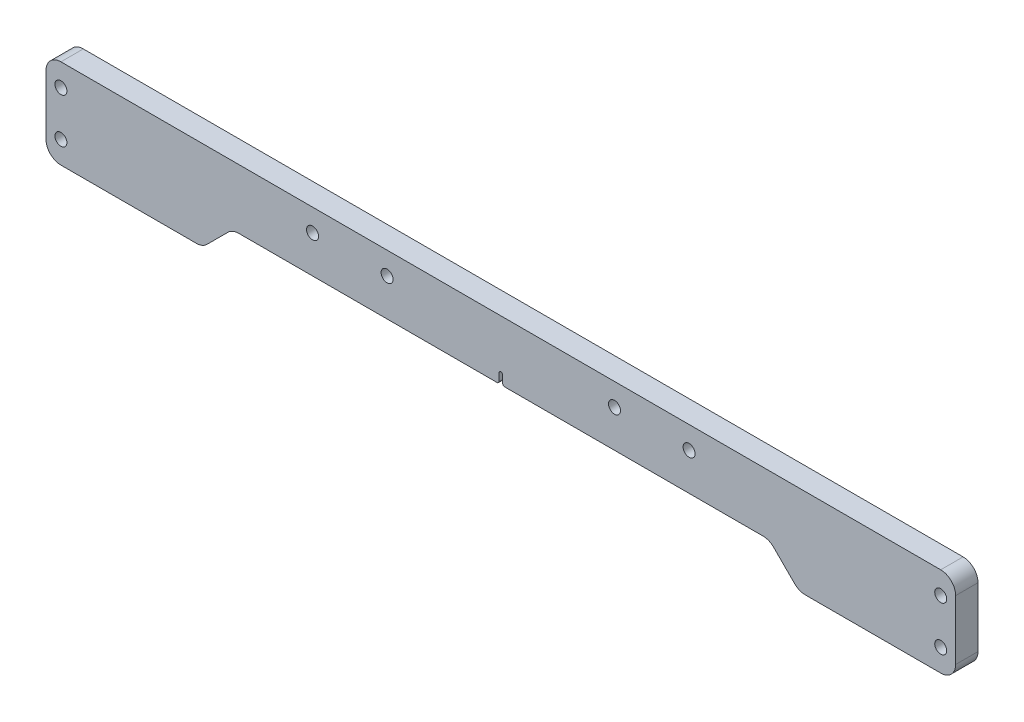
ISO-10303-21;
HEADER;
FILE_DESCRIPTION(('STEP AP214'),'2;1');
FILE_NAME('part.step','',(''),(''),'','','');
FILE_SCHEMA(('AUTOMOTIVE_DESIGN { 1 0 10303 214 1 1 1 1 }'));
ENDSEC;
DATA;
#1=APPLICATION_CONTEXT('core data for automotive mechanical design processes');
#2=APPLICATION_PROTOCOL_DEFINITION('international standard','automotive_design',2000,#1);
#3=PRODUCT_CONTEXT('',#1,'mechanical');
#4=PRODUCT('Part','Part','',(#3));
#5=PRODUCT_RELATED_PRODUCT_CATEGORY('part','',(#4));
#6=PRODUCT_DEFINITION_FORMATION('','',#4);
#7=PRODUCT_DEFINITION_CONTEXT('part definition',#1,'design');
#8=PRODUCT_DEFINITION('design','',#6,#7);
#9=PRODUCT_DEFINITION_SHAPE('','',#8);
#10=(LENGTH_UNIT() NAMED_UNIT(*) SI_UNIT(.MILLI.,.METRE.));
#11=(NAMED_UNIT(*) PLANE_ANGLE_UNIT() SI_UNIT($,.RADIAN.));
#12=(NAMED_UNIT(*) SI_UNIT($,.STERADIAN.) SOLID_ANGLE_UNIT());
#13=UNCERTAINTY_MEASURE_WITH_UNIT(LENGTH_MEASURE(1.E-05),#10,'distance_accuracy_value','');
#14=(GEOMETRIC_REPRESENTATION_CONTEXT(3) GLOBAL_UNCERTAINTY_ASSIGNED_CONTEXT((#13)) GLOBAL_UNIT_ASSIGNED_CONTEXT((#10,
#11,#12)) REPRESENTATION_CONTEXT('',''));
#15=CARTESIAN_POINT('',(0.,0.,0.));
#16=DIRECTION('',(0.,0.,1.));
#17=DIRECTION('',(1.,0.,0.));
#18=AXIS2_PLACEMENT_3D('',#15,#16,#17);
#19=CARTESIAN_POINT('',(-193.675,-19.05,9.525));
#20=DIRECTION('',(0.,0.,-1.));
#21=DIRECTION('',(-1.,0.,0.));
#22=AXIS2_PLACEMENT_3D('',#19,#20,#21);
#23=PLANE('',#22);
#24=CARTESIAN_POINT('',(-187.325,9.52500000000002,9.525));
#25=DIRECTION('',(0.,0.,1.));
#26=DIRECTION('',(1.,0.,0.));
#27=AXIS2_PLACEMENT_3D('',#24,#25,#26);
#28=CIRCLE('',#27,2.55269999999999);
#29=CARTESIAN_POINT('',(-184.7723,9.52500000000002,9.525));
#30=VERTEX_POINT('',#29);
#31=EDGE_CURVE('E247',#30,#30,#28,.T.);
#32=ORIENTED_EDGE('',*,*,#31,.F.);
#33=EDGE_LOOP('',(#32));
#34=FACE_BOUND('',#33,.T.);
#35=CARTESIAN_POINT('',(187.325,9.52500000000002,9.525));
#36=DIRECTION('',(0.,0.,1.));
#37=DIRECTION('',(1.,0.,0.));
#38=AXIS2_PLACEMENT_3D('',#35,#36,#37);
#39=CIRCLE('',#38,2.55269999999999);
#40=CARTESIAN_POINT('',(189.8777,9.52500000000002,9.525));
#41=VERTEX_POINT('',#40);
#42=EDGE_CURVE('E253',#41,#41,#39,.T.);
#43=ORIENTED_EDGE('',*,*,#42,.F.);
#44=EDGE_LOOP('',(#43));
#45=FACE_BOUND('',#44,.T.);
#46=CARTESIAN_POINT('',(-187.325,-9.525,9.525));
#47=DIRECTION('',(0.,0.,1.));
#48=DIRECTION('',(1.,0.,0.));
#49=AXIS2_PLACEMENT_3D('',#46,#47,#48);
#50=CIRCLE('',#49,2.55269999999999);
#51=CARTESIAN_POINT('',(-184.7723,-9.525,9.525));
#52=VERTEX_POINT('',#51);
#53=EDGE_CURVE('E259',#52,#52,#50,.T.);
#54=ORIENTED_EDGE('',*,*,#53,.F.);
#55=EDGE_LOOP('',(#54));
#56=FACE_BOUND('',#55,.T.);
#57=CARTESIAN_POINT('',(-48.4187500000001,9.52500000000017,9.525));
#58=DIRECTION('',(0.,0.,1.));
#59=DIRECTION('',(1.,0.,0.));
#60=AXIS2_PLACEMENT_3D('',#57,#58,#59);
#61=CIRCLE('',#60,2.5527);
#62=CARTESIAN_POINT('',(-45.8660500000001,9.52500000000017,9.525));
#63=VERTEX_POINT('',#62);
#64=EDGE_CURVE('E277',#63,#63,#61,.T.);
#65=ORIENTED_EDGE('',*,*,#64,.F.);
#66=EDGE_LOOP('',(#65));
#67=FACE_BOUND('',#66,.T.);
#68=CARTESIAN_POINT('',(80.1687499999999,9.52500000000017,9.525));
#69=DIRECTION('',(0.,0.,1.));
#70=DIRECTION('',(1.,0.,0.));
#71=AXIS2_PLACEMENT_3D('',#68,#69,#70);
#72=CIRCLE('',#71,2.55270000000001);
#73=CARTESIAN_POINT('',(82.7214499999999,9.52500000000017,9.525));
#74=VERTEX_POINT('',#73);
#75=EDGE_CURVE('E289',#74,#74,#72,.T.);
#76=ORIENTED_EDGE('',*,*,#75,.F.);
#77=EDGE_LOOP('',(#76));
#78=FACE_BOUND('',#77,.T.);
#79=CARTESIAN_POINT('',(48.4187499999999,9.52500000000017,9.525));
#80=DIRECTION('',(0.,0.,1.));
#81=DIRECTION('',(1.,0.,0.));
#82=AXIS2_PLACEMENT_3D('',#79,#80,#81);
#83=CIRCLE('',#82,2.5527);
#84=CARTESIAN_POINT('',(50.9714499999999,9.52500000000017,9.525));
#85=VERTEX_POINT('',#84);
#86=EDGE_CURVE('E283',#85,#85,#83,.T.);
#87=ORIENTED_EDGE('',*,*,#86,.F.);
#88=EDGE_LOOP('',(#87));
#89=FACE_BOUND('',#88,.T.);
#90=CARTESIAN_POINT('',(-80.1687500000001,9.52500000000017,9.525));
#91=DIRECTION('',(0.,0.,1.));
#92=DIRECTION('',(1.,0.,0.));
#93=AXIS2_PLACEMENT_3D('',#90,#91,#92);
#94=CIRCLE('',#93,2.55270000000001);
#95=CARTESIAN_POINT('',(-77.6160500000001,9.52500000000017,9.525));
#96=VERTEX_POINT('',#95);
#97=EDGE_CURVE('E271',#96,#96,#94,.T.);
#98=ORIENTED_EDGE('',*,*,#97,.F.);
#99=EDGE_LOOP('',(#98));
#100=FACE_BOUND('',#99,.T.);
#101=CARTESIAN_POINT('',(187.325,-9.525,9.525));
#102=DIRECTION('',(0.,0.,1.));
#103=DIRECTION('',(1.,0.,0.));
#104=AXIS2_PLACEMENT_3D('',#101,#102,#103);
#105=CIRCLE('',#104,2.55269999999999);
#106=CARTESIAN_POINT('',(189.8777,-9.525,9.525));
#107=VERTEX_POINT('',#106);
#108=EDGE_CURVE('E265',#107,#107,#105,.T.);
#109=ORIENTED_EDGE('',*,*,#108,.F.);
#110=EDGE_LOOP('',(#109));
#111=FACE_BOUND('',#110,.T.);
#112=DIRECTION('',(0.,1.,0.));
#113=VECTOR('',#112,1.);
#114=CARTESIAN_POINT('',(0.79375000000001,-19.05,9.525));
#115=LINE('',#114,#113);
#116=CARTESIAN_POINT('',(0.79375000000001,-5.55625000000003,9.525));
#117=VERTEX_POINT('',#116);
#118=CARTESIAN_POINT('',(0.79375000000001,-2.37490000000002,9.525));
#119=VERTEX_POINT('',#118);
#120=EDGE_CURVE('E199',#117,#119,#115,.T.);
#121=ORIENTED_EDGE('',*,*,#120,.F.);
#122=CARTESIAN_POINT('',(1.5875,-5.55625000000003,9.525));
#123=DIRECTION('',(0.,0.,-1.));
#124=DIRECTION('',(-1.,0.,0.));
#125=AXIS2_PLACEMENT_3D('',#122,#123,#124);
#126=CIRCLE('',#125,0.79375);
#127=CARTESIAN_POINT('',(1.58750000000003,-6.35000000000003,9.525));
#128=VERTEX_POINT('',#127);
#129=EDGE_CURVE('E418',#117,#128,#126,.F.);
#130=ORIENTED_EDGE('',*,*,#129,.T.);
#131=DIRECTION('',(-1.,0.,0.));
#132=VECTOR('',#131,1.);
#133=CARTESIAN_POINT('',(114.3,-6.35000000000002,9.525));
#134=LINE('',#133,#132);
#135=CARTESIAN_POINT('',(111.669743878931,-6.35000000000002,9.525));
#136=VERTEX_POINT('',#135);
#137=EDGE_CURVE('E296',#136,#128,#134,.T.);
#138=ORIENTED_EDGE('',*,*,#137,.F.);
#139=CARTESIAN_POINT('',(111.669743878931,-12.7,9.525));
#140=DIRECTION('',(0.,0.,-1.));
#141=DIRECTION('',(-1.,0.,0.));
#142=AXIS2_PLACEMENT_3D('',#139,#140,#141);
#143=CIRCLE('',#142,6.35);
#144=CARTESIAN_POINT('',(116.159871939465,-8.20987193946544,9.525));
#145=VERTEX_POINT('',#144);
#146=EDGE_CURVE('E411',#136,#145,#143,.T.);
#147=ORIENTED_EDGE('',*,*,#146,.T.);
#148=DIRECTION('',(-0.707106781186548,0.707106781186547,0.));
#149=VECTOR('',#148,1.);
#150=CARTESIAN_POINT('',(114.3,-6.35,9.525));
#151=LINE('',#150,#149);
#152=CARTESIAN_POINT('',(125.140128060535,-17.1901280605346,9.525));
#153=VERTEX_POINT('',#152);
#154=EDGE_CURVE('E332',#145,#153,#151,.F.);
#155=ORIENTED_EDGE('',*,*,#154,.T.);
#156=CARTESIAN_POINT('',(129.630256121069,-12.7,9.525));
#157=DIRECTION('',(0.,0.,-1.));
#158=DIRECTION('',(-1.,0.,0.));
#159=AXIS2_PLACEMENT_3D('',#156,#157,#158);
#160=CIRCLE('',#159,6.35);
#161=CARTESIAN_POINT('',(129.630256121069,-19.05,9.525));
#162=VERTEX_POINT('',#161);
#163=EDGE_CURVE('E355',#153,#162,#160,.F.);
#164=ORIENTED_EDGE('',*,*,#163,.T.);
#165=DIRECTION('',(1.,0.,0.));
#166=VECTOR('',#165,1.);
#167=CARTESIAN_POINT('',(193.675,-19.05,9.525));
#168=LINE('',#167,#166);
#169=CARTESIAN_POINT('',(187.325,-19.05,9.525));
#170=VERTEX_POINT('',#169);
#171=EDGE_CURVE('E307',#162,#170,#168,.T.);
#172=ORIENTED_EDGE('',*,*,#171,.T.);
#173=CARTESIAN_POINT('',(187.325,-12.7,9.525));
#174=DIRECTION('',(0.,0.,-1.));
#175=DIRECTION('',(-1.,0.,0.));
#176=AXIS2_PLACEMENT_3D('',#173,#174,#175);
#177=CIRCLE('',#176,6.35);
#178=CARTESIAN_POINT('',(193.675,-12.7,9.525));
#179=VERTEX_POINT('',#178);
#180=EDGE_CURVE('E351',#170,#179,#177,.F.);
#181=ORIENTED_EDGE('',*,*,#180,.T.);
#182=DIRECTION('',(0.,1.,0.));
#183=VECTOR('',#182,1.);
#184=CARTESIAN_POINT('',(193.675,19.05,9.525));
#185=LINE('',#184,#183);
#186=CARTESIAN_POINT('',(193.675,12.7,9.525));
#187=VERTEX_POINT('',#186);
#188=EDGE_CURVE('E312',#179,#187,#185,.T.);
#189=ORIENTED_EDGE('',*,*,#188,.T.);
#190=CARTESIAN_POINT('',(187.325,12.7,9.525));
#191=DIRECTION('',(0.,0.,-1.));
#192=DIRECTION('',(-1.,0.,0.));
#193=AXIS2_PLACEMENT_3D('',#190,#191,#192);
#194=CIRCLE('',#193,6.35);
#195=CARTESIAN_POINT('',(187.325,19.05,9.525));
#196=VERTEX_POINT('',#195);
#197=EDGE_CURVE('E349',#187,#196,#194,.F.);
#198=ORIENTED_EDGE('',*,*,#197,.T.);
#199=DIRECTION('',(-1.,0.,0.));
#200=VECTOR('',#199,1.);
#201=CARTESIAN_POINT('',(193.675,19.05,9.525));
#202=LINE('',#201,#200);
#203=CARTESIAN_POINT('',(-187.325,19.05,9.525));
#204=VERTEX_POINT('',#203);
#205=EDGE_CURVE('E315',#196,#204,#202,.T.);
#206=ORIENTED_EDGE('',*,*,#205,.T.);
#207=CARTESIAN_POINT('',(-187.325,12.7,9.525));
#208=DIRECTION('',(0.,0.,-1.));
#209=DIRECTION('',(-1.,0.,0.));
#210=AXIS2_PLACEMENT_3D('',#207,#208,#209);
#211=CIRCLE('',#210,6.35);
#212=CARTESIAN_POINT('',(-193.675,12.7,9.525));
#213=VERTEX_POINT('',#212);
#214=EDGE_CURVE('E347',#204,#213,#211,.F.);
#215=ORIENTED_EDGE('',*,*,#214,.T.);
#216=DIRECTION('',(0.,-1.,0.));
#217=VECTOR('',#216,1.);
#218=CARTESIAN_POINT('',(-193.675,19.05,9.525));
#219=LINE('',#218,#217);
#220=CARTESIAN_POINT('',(-193.675,-12.7,9.525));
#221=VERTEX_POINT('',#220);
#222=EDGE_CURVE('E304',#213,#221,#219,.T.);
#223=ORIENTED_EDGE('',*,*,#222,.T.);
#224=CARTESIAN_POINT('',(-187.325,-12.7,9.525));
#225=DIRECTION('',(0.,0.,-1.));
#226=DIRECTION('',(-1.,0.,0.));
#227=AXIS2_PLACEMENT_3D('',#224,#225,#226);
#228=CIRCLE('',#227,6.35);
#229=CARTESIAN_POINT('',(-187.325,-19.05,9.525));
#230=VERTEX_POINT('',#229);
#231=EDGE_CURVE('E353',#221,#230,#228,.F.);
#232=ORIENTED_EDGE('',*,*,#231,.T.);
#233=CARTESIAN_POINT('',(-129.630256121069,-19.05,9.525));
#234=VERTEX_POINT('',#233);
#235=EDGE_CURVE('E311',#230,#234,#168,.T.);
#236=ORIENTED_EDGE('',*,*,#235,.T.);
#237=CARTESIAN_POINT('',(-129.630256121069,-12.7,9.525));
#238=DIRECTION('',(0.,0.,-1.));
#239=DIRECTION('',(-1.,0.,0.));
#240=AXIS2_PLACEMENT_3D('',#237,#238,#239);
#241=CIRCLE('',#240,6.35);
#242=CARTESIAN_POINT('',(-125.140128060535,-17.1901280605346,9.525));
#243=VERTEX_POINT('',#242);
#244=EDGE_CURVE('E357',#234,#243,#241,.F.);
#245=ORIENTED_EDGE('',*,*,#244,.T.);
#246=DIRECTION('',(-0.707106781186547,-0.707106781186548,0.));
#247=VECTOR('',#246,1.);
#248=CARTESIAN_POINT('',(-127.,-19.05,9.525));
#249=LINE('',#248,#247);
#250=CARTESIAN_POINT('',(-116.159871939466,-8.20987193946548,9.525));
#251=VERTEX_POINT('',#250);
#252=EDGE_CURVE('E318',#243,#251,#249,.F.);
#253=ORIENTED_EDGE('',*,*,#252,.T.);
#254=CARTESIAN_POINT('',(-111.669743878931,-12.7,9.525));
#255=DIRECTION('',(0.,0.,-1.));
#256=DIRECTION('',(-1.,0.,0.));
#257=AXIS2_PLACEMENT_3D('',#254,#255,#256);
#258=CIRCLE('',#257,6.35);
#259=CARTESIAN_POINT('',(-111.669743878931,-6.35000000000005,9.525));
#260=VERTEX_POINT('',#259);
#261=EDGE_CURVE('E406',#251,#260,#258,.T.);
#262=ORIENTED_EDGE('',*,*,#261,.T.);
#263=CARTESIAN_POINT('',(-1.58749999999998,-6.35000000000003,9.525));
#264=VERTEX_POINT('',#263);
#265=EDGE_CURVE('E295',#264,#260,#134,.T.);
#266=ORIENTED_EDGE('',*,*,#265,.F.);
#267=CARTESIAN_POINT('',(-1.58750000000001,-5.55625000000003,9.525));
#268=DIRECTION('',(0.,0.,-1.));
#269=DIRECTION('',(-1.,0.,0.));
#270=AXIS2_PLACEMENT_3D('',#267,#268,#269);
#271=CIRCLE('',#270,0.79375);
#272=CARTESIAN_POINT('',(-0.79375000000001,-5.55625000000003,9.525));
#273=VERTEX_POINT('',#272);
#274=EDGE_CURVE('E416',#264,#273,#271,.F.);
#275=ORIENTED_EDGE('',*,*,#274,.T.);
#276=DIRECTION('',(0.,1.,0.));
#277=VECTOR('',#276,1.);
#278=CARTESIAN_POINT('',(-0.79375000000001,-19.05,9.525));
#279=LINE('',#278,#277);
#280=CARTESIAN_POINT('',(-0.79375000000001,-2.37490000000002,9.525));
#281=VERTEX_POINT('',#280);
#282=EDGE_CURVE('E227',#281,#273,#279,.F.);
#283=ORIENTED_EDGE('',*,*,#282,.F.);
#284=CARTESIAN_POINT('',(-0.00635000000000002,-2.37490000000002,9.525));
#285=DIRECTION('',(0.,0.,-1.));
#286=DIRECTION('',(-1.,0.,0.));
#287=AXIS2_PLACEMENT_3D('',#284,#285,#286);
#288=CIRCLE('',#287,0.7874);
#289=CARTESIAN_POINT('',(-0.00634999999998831,-1.58750000000002,9.525));
#290=VERTEX_POINT('',#289);
#291=EDGE_CURVE('E223',#290,#281,#288,.F.);
#292=ORIENTED_EDGE('',*,*,#291,.F.);
#293=DIRECTION('',(-1.,0.,0.));
#294=VECTOR('',#293,1.);
#295=CARTESIAN_POINT('',(-193.675,-1.58750000000002,9.525));
#296=LINE('',#295,#294);
#297=CARTESIAN_POINT('',(0.00634999999998831,-1.58750000000002,9.525));
#298=VERTEX_POINT('',#297);
#299=EDGE_CURVE('E221',#298,#290,#296,.T.);
#300=ORIENTED_EDGE('',*,*,#299,.F.);
#301=CARTESIAN_POINT('',(0.00635000000000002,-2.37490000000002,9.525));
#302=DIRECTION('',(0.,0.,-1.));
#303=DIRECTION('',(-1.,0.,0.));
#304=AXIS2_PLACEMENT_3D('',#301,#302,#303);
#305=CIRCLE('',#304,0.7874);
#306=EDGE_CURVE('E208',#119,#298,#305,.F.);
#307=ORIENTED_EDGE('',*,*,#306,.F.);
#308=EDGE_LOOP('',(#121,#130,#138,#147,#155,#164,#172,#181,#189,#198,#206,#215,#223,#232,#236,
#245,#253,#262,#266,#275,#283,#292,#300,#307));
#309=FACE_BOUND('',#308,.T.);
#310=ADVANCED_FACE('F38',(#34,#45,#56,#67,#78,#89,#100,#111,#309),#23,.F.);
#311=CARTESIAN_POINT('',(-193.675,-19.05,0.));
#312=DIRECTION('',(0.,0.,-1.));
#313=DIRECTION('',(-1.,0.,0.));
#314=AXIS2_PLACEMENT_3D('',#311,#312,#313);
#315=PLANE('',#314);
#316=CARTESIAN_POINT('',(-187.325,9.52500000000002,0.));
#317=DIRECTION('',(0.,0.,-1.));
#318=DIRECTION('',(-1.,0.,0.));
#319=AXIS2_PLACEMENT_3D('',#316,#317,#318);
#320=CIRCLE('',#319,2.55269999999999);
#321=CARTESIAN_POINT('',(-189.8777,9.52500000000002,0.));
#322=VERTEX_POINT('',#321);
#323=EDGE_CURVE('E250',#322,#322,#320,.T.);
#324=ORIENTED_EDGE('',*,*,#323,.F.);
#325=EDGE_LOOP('',(#324));
#326=FACE_BOUND('',#325,.T.);
#327=CARTESIAN_POINT('',(187.325,9.52500000000002,0.));
#328=DIRECTION('',(0.,0.,-1.));
#329=DIRECTION('',(-1.,0.,0.));
#330=AXIS2_PLACEMENT_3D('',#327,#328,#329);
#331=CIRCLE('',#330,2.55269999999999);
#332=CARTESIAN_POINT('',(184.7723,9.52500000000002,0.));
#333=VERTEX_POINT('',#332);
#334=EDGE_CURVE('E256',#333,#333,#331,.T.);
#335=ORIENTED_EDGE('',*,*,#334,.F.);
#336=EDGE_LOOP('',(#335));
#337=FACE_BOUND('',#336,.T.);
#338=CARTESIAN_POINT('',(-187.325,-9.525,0.));
#339=DIRECTION('',(0.,0.,-1.));
#340=DIRECTION('',(-1.,0.,0.));
#341=AXIS2_PLACEMENT_3D('',#338,#339,#340);
#342=CIRCLE('',#341,2.55269999999999);
#343=CARTESIAN_POINT('',(-189.8777,-9.525,0.));
#344=VERTEX_POINT('',#343);
#345=EDGE_CURVE('E262',#344,#344,#342,.T.);
#346=ORIENTED_EDGE('',*,*,#345,.F.);
#347=EDGE_LOOP('',(#346));
#348=FACE_BOUND('',#347,.T.);
#349=CARTESIAN_POINT('',(187.325,-9.525,0.));
#350=DIRECTION('',(0.,0.,-1.));
#351=DIRECTION('',(-1.,0.,0.));
#352=AXIS2_PLACEMENT_3D('',#349,#350,#351);
#353=CIRCLE('',#352,2.55269999999999);
#354=CARTESIAN_POINT('',(184.7723,-9.525,0.));
#355=VERTEX_POINT('',#354);
#356=EDGE_CURVE('E268',#355,#355,#353,.T.);
#357=ORIENTED_EDGE('',*,*,#356,.F.);
#358=EDGE_LOOP('',(#357));
#359=FACE_BOUND('',#358,.T.);
#360=CARTESIAN_POINT('',(-80.1687500000001,9.52500000000017,0.));
#361=DIRECTION('',(0.,0.,-1.));
#362=DIRECTION('',(-1.,0.,0.));
#363=AXIS2_PLACEMENT_3D('',#360,#361,#362);
#364=CIRCLE('',#363,2.5527);
#365=CARTESIAN_POINT('',(-82.7214500000001,9.52500000000017,0.));
#366=VERTEX_POINT('',#365);
#367=EDGE_CURVE('E274',#366,#366,#364,.T.);
#368=ORIENTED_EDGE('',*,*,#367,.F.);
#369=EDGE_LOOP('',(#368));
#370=FACE_BOUND('',#369,.T.);
#371=CARTESIAN_POINT('',(-48.4187500000001,9.52500000000017,0.));
#372=DIRECTION('',(0.,0.,-1.));
#373=DIRECTION('',(-1.,0.,0.));
#374=AXIS2_PLACEMENT_3D('',#371,#372,#373);
#375=CIRCLE('',#374,2.5527);
#376=CARTESIAN_POINT('',(-50.9714500000001,9.52500000000017,0.));
#377=VERTEX_POINT('',#376);
#378=EDGE_CURVE('E280',#377,#377,#375,.T.);
#379=ORIENTED_EDGE('',*,*,#378,.F.);
#380=EDGE_LOOP('',(#379));
#381=FACE_BOUND('',#380,.T.);
#382=CARTESIAN_POINT('',(48.4187499999999,9.52500000000017,0.));
#383=DIRECTION('',(0.,0.,-1.));
#384=DIRECTION('',(-1.,0.,0.));
#385=AXIS2_PLACEMENT_3D('',#382,#383,#384);
#386=CIRCLE('',#385,2.5527);
#387=CARTESIAN_POINT('',(45.8660499999999,9.52500000000017,0.));
#388=VERTEX_POINT('',#387);
#389=EDGE_CURVE('E286',#388,#388,#386,.T.);
#390=ORIENTED_EDGE('',*,*,#389,.F.);
#391=EDGE_LOOP('',(#390));
#392=FACE_BOUND('',#391,.T.);
#393=CARTESIAN_POINT('',(80.1687499999999,9.52500000000017,0.));
#394=DIRECTION('',(0.,0.,-1.));
#395=DIRECTION('',(-1.,0.,0.));
#396=AXIS2_PLACEMENT_3D('',#393,#394,#395);
#397=CIRCLE('',#396,2.5527);
#398=CARTESIAN_POINT('',(77.6160499999999,9.52500000000017,0.));
#399=VERTEX_POINT('',#398);
#400=EDGE_CURVE('E292',#399,#399,#397,.T.);
#401=ORIENTED_EDGE('',*,*,#400,.F.);
#402=EDGE_LOOP('',(#401));
#403=FACE_BOUND('',#402,.T.);
#404=DIRECTION('',(-1.,0.,0.));
#405=VECTOR('',#404,1.);
#406=CARTESIAN_POINT('',(114.3,-6.35000000000002,0.));
#407=LINE('',#406,#405);
#408=CARTESIAN_POINT('',(111.669743878931,-6.35000000000002,0.));
#409=VERTEX_POINT('',#408);
#410=CARTESIAN_POINT('',(1.58750000000001,-6.35000000000003,0.));
#411=VERTEX_POINT('',#410);
#412=EDGE_CURVE('E300',#409,#411,#407,.T.);
#413=ORIENTED_EDGE('',*,*,#412,.T.);
#414=CARTESIAN_POINT('',(1.5875,-5.55625000000003,0.));
#415=DIRECTION('',(0.,0.,-1.));
#416=DIRECTION('',(-1.,0.,0.));
#417=AXIS2_PLACEMENT_3D('',#414,#415,#416);
#418=CIRCLE('',#417,0.79375);
#419=CARTESIAN_POINT('',(0.793750000000001,-5.55625000000003,0.));
#420=VERTEX_POINT('',#419);
#421=EDGE_CURVE('E423',#411,#420,#418,.T.);
#422=ORIENTED_EDGE('',*,*,#421,.T.);
#423=DIRECTION('',(0.,1.,0.));
#424=VECTOR('',#423,1.);
#425=CARTESIAN_POINT('',(0.793750000000001,-6.35000000000002,0.));
#426=LINE('',#425,#424);
#427=CARTESIAN_POINT('',(0.79375,-2.37490000000002,0.));
#428=VERTEX_POINT('',#427);
#429=EDGE_CURVE('E229',#420,#428,#426,.T.);
#430=ORIENTED_EDGE('',*,*,#429,.T.);
#431=CARTESIAN_POINT('',(0.00635000000000002,-2.37490000000002,0.));
#432=DIRECTION('',(0.,0.,-1.));
#433=DIRECTION('',(-1.,0.,0.));
#434=AXIS2_PLACEMENT_3D('',#431,#432,#433);
#435=CIRCLE('',#434,0.7874);
#436=CARTESIAN_POINT('',(0.00635000000000007,-1.58750000000002,0.));
#437=VERTEX_POINT('',#436);
#438=EDGE_CURVE('E216',#428,#437,#435,.F.);
#439=ORIENTED_EDGE('',*,*,#438,.T.);
#440=DIRECTION('',(-1.,0.,0.));
#441=VECTOR('',#440,1.);
#442=CARTESIAN_POINT('',(-0.00635000000000002,-1.58750000000002,0.));
#443=LINE('',#442,#441);
#444=CARTESIAN_POINT('',(-0.00635000000000002,-1.58750000000002,0.));
#445=VERTEX_POINT('',#444);
#446=EDGE_CURVE('E235',#437,#445,#443,.T.);
#447=ORIENTED_EDGE('',*,*,#446,.T.);
#448=CARTESIAN_POINT('',(-0.00635000000000002,-2.37490000000002,0.));
#449=DIRECTION('',(0.,0.,-1.));
#450=DIRECTION('',(-1.,0.,0.));
#451=AXIS2_PLACEMENT_3D('',#448,#449,#450);
#452=CIRCLE('',#451,0.7874);
#453=CARTESIAN_POINT('',(-0.79375,-2.37490000000002,0.));
#454=VERTEX_POINT('',#453);
#455=EDGE_CURVE('E232',#445,#454,#452,.F.);
#456=ORIENTED_EDGE('',*,*,#455,.T.);
#457=DIRECTION('',(0.,-1.,0.));
#458=VECTOR('',#457,1.);
#459=CARTESIAN_POINT('',(-0.793749999999999,-6.35000000000002,0.));
#460=LINE('',#459,#458);
#461=CARTESIAN_POINT('',(-0.793749999999999,-5.55625000000003,0.));
#462=VERTEX_POINT('',#461);
#463=EDGE_CURVE('E230',#454,#462,#460,.T.);
#464=ORIENTED_EDGE('',*,*,#463,.T.);
#465=CARTESIAN_POINT('',(-1.58750000000001,-5.55625000000003,0.));
#466=DIRECTION('',(0.,0.,-1.));
#467=DIRECTION('',(-1.,0.,0.));
#468=AXIS2_PLACEMENT_3D('',#465,#466,#467);
#469=CIRCLE('',#468,0.79375);
#470=CARTESIAN_POINT('',(-1.58750000000001,-6.35000000000003,0.));
#471=VERTEX_POINT('',#470);
#472=EDGE_CURVE('E53',#462,#471,#469,.T.);
#473=ORIENTED_EDGE('',*,*,#472,.T.);
#474=CARTESIAN_POINT('',(-111.669743878931,-6.35000000000005,0.));
#475=VERTEX_POINT('',#474);
#476=EDGE_CURVE('E299',#471,#475,#407,.T.);
#477=ORIENTED_EDGE('',*,*,#476,.T.);
#478=CARTESIAN_POINT('',(-111.669743878931,-12.7,0.));
#479=DIRECTION('',(0.,0.,-1.));
#480=DIRECTION('',(-1.,0.,0.));
#481=AXIS2_PLACEMENT_3D('',#478,#479,#480);
#482=CIRCLE('',#481,6.35);
#483=CARTESIAN_POINT('',(-116.159871939466,-8.20987193946547,0.));
#484=VERTEX_POINT('',#483);
#485=EDGE_CURVE('E409',#475,#484,#482,.F.);
#486=ORIENTED_EDGE('',*,*,#485,.T.);
#487=DIRECTION('',(0.707106781186547,0.707106781186548,0.));
#488=VECTOR('',#487,1.);
#489=CARTESIAN_POINT('',(-160.3375,-52.3875,0.));
#490=LINE('',#489,#488);
#491=CARTESIAN_POINT('',(-125.140128060535,-17.1901280605346,0.));
#492=VERTEX_POINT('',#491);
#493=EDGE_CURVE('E335',#484,#492,#490,.F.);
#494=ORIENTED_EDGE('',*,*,#493,.T.);
#495=CARTESIAN_POINT('',(-129.630256121069,-12.7,0.));
#496=DIRECTION('',(0.,0.,-1.));
#497=DIRECTION('',(-1.,0.,0.));
#498=AXIS2_PLACEMENT_3D('',#495,#496,#497);
#499=CIRCLE('',#498,6.35);
#500=CARTESIAN_POINT('',(-129.630256121069,-19.05,0.));
#501=VERTEX_POINT('',#500);
#502=EDGE_CURVE('E374',#492,#501,#499,.T.);
#503=ORIENTED_EDGE('',*,*,#502,.T.);
#504=DIRECTION('',(1.,0.,0.));
#505=VECTOR('',#504,1.);
#506=CARTESIAN_POINT('',(193.675,-19.05,0.));
#507=LINE('',#506,#505);
#508=CARTESIAN_POINT('',(-187.325,-19.05,0.));
#509=VERTEX_POINT('',#508);
#510=EDGE_CURVE('E324',#509,#501,#507,.T.);
#511=ORIENTED_EDGE('',*,*,#510,.F.);
#512=CARTESIAN_POINT('',(-187.325,-12.7,0.));
#513=DIRECTION('',(0.,0.,-1.));
#514=DIRECTION('',(-1.,0.,0.));
#515=AXIS2_PLACEMENT_3D('',#512,#513,#514);
#516=CIRCLE('',#515,6.35);
#517=CARTESIAN_POINT('',(-193.675,-12.7,0.));
#518=VERTEX_POINT('',#517);
#519=EDGE_CURVE('E370',#509,#518,#516,.T.);
#520=ORIENTED_EDGE('',*,*,#519,.T.);
#521=DIRECTION('',(0.,-1.,0.));
#522=VECTOR('',#521,1.);
#523=CARTESIAN_POINT('',(-193.675,19.05,0.));
#524=LINE('',#523,#522);
#525=CARTESIAN_POINT('',(-193.675,12.7,0.));
#526=VERTEX_POINT('',#525);
#527=EDGE_CURVE('E303',#526,#518,#524,.T.);
#528=ORIENTED_EDGE('',*,*,#527,.F.);
#529=CARTESIAN_POINT('',(-187.325,12.7,0.));
#530=DIRECTION('',(0.,0.,-1.));
#531=DIRECTION('',(-1.,0.,0.));
#532=AXIS2_PLACEMENT_3D('',#529,#530,#531);
#533=CIRCLE('',#532,6.35);
#534=CARTESIAN_POINT('',(-187.325,19.05,0.));
#535=VERTEX_POINT('',#534);
#536=EDGE_CURVE('E364',#526,#535,#533,.T.);
#537=ORIENTED_EDGE('',*,*,#536,.T.);
#538=DIRECTION('',(-1.,0.,0.));
#539=VECTOR('',#538,1.);
#540=CARTESIAN_POINT('',(193.675,19.05,0.));
#541=LINE('',#540,#539);
#542=CARTESIAN_POINT('',(187.325,19.05,0.));
#543=VERTEX_POINT('',#542);
#544=EDGE_CURVE('E308',#543,#535,#541,.T.);
#545=ORIENTED_EDGE('',*,*,#544,.F.);
#546=CARTESIAN_POINT('',(187.325,12.7,0.));
#547=DIRECTION('',(0.,0.,-1.));
#548=DIRECTION('',(-1.,0.,0.));
#549=AXIS2_PLACEMENT_3D('',#546,#547,#548);
#550=CIRCLE('',#549,6.35);
#551=CARTESIAN_POINT('',(193.675,12.7,0.));
#552=VERTEX_POINT('',#551);
#553=EDGE_CURVE('E366',#543,#552,#550,.T.);
#554=ORIENTED_EDGE('',*,*,#553,.T.);
#555=DIRECTION('',(0.,1.,0.));
#556=VECTOR('',#555,1.);
#557=CARTESIAN_POINT('',(193.675,19.05,0.));
#558=LINE('',#557,#556);
#559=CARTESIAN_POINT('',(193.675,-12.7,0.));
#560=VERTEX_POINT('',#559);
#561=EDGE_CURVE('E325',#560,#552,#558,.T.);
#562=ORIENTED_EDGE('',*,*,#561,.F.);
#563=CARTESIAN_POINT('',(187.325,-12.7,0.));
#564=DIRECTION('',(0.,0.,-1.));
#565=DIRECTION('',(-1.,0.,0.));
#566=AXIS2_PLACEMENT_3D('',#563,#564,#565);
#567=CIRCLE('',#566,6.35);
#568=CARTESIAN_POINT('',(187.325,-19.05,0.));
#569=VERTEX_POINT('',#568);
#570=EDGE_CURVE('E368',#560,#569,#567,.T.);
#571=ORIENTED_EDGE('',*,*,#570,.T.);
#572=CARTESIAN_POINT('',(129.630256121069,-19.05,0.));
#573=VERTEX_POINT('',#572);
#574=EDGE_CURVE('E321',#573,#569,#507,.T.);
#575=ORIENTED_EDGE('',*,*,#574,.F.);
#576=CARTESIAN_POINT('',(129.630256121069,-12.7,0.));
#577=DIRECTION('',(0.,0.,-1.));
#578=DIRECTION('',(-1.,0.,0.));
#579=AXIS2_PLACEMENT_3D('',#576,#577,#578);
#580=CIRCLE('',#579,6.35);
#581=CARTESIAN_POINT('',(125.140128060535,-17.1901280605346,0.));
#582=VERTEX_POINT('',#581);
#583=EDGE_CURVE('E372',#573,#582,#580,.T.);
#584=ORIENTED_EDGE('',*,*,#583,.T.);
#585=DIRECTION('',(0.707106781186548,-0.707106781186547,0.));
#586=VECTOR('',#585,1.);
#587=CARTESIAN_POINT('',(-33.3375,141.2875,0.));
#588=LINE('',#587,#586);
#589=CARTESIAN_POINT('',(116.159871939465,-8.20987193946546,0.));
#590=VERTEX_POINT('',#589);
#591=EDGE_CURVE('E338',#582,#590,#588,.F.);
#592=ORIENTED_EDGE('',*,*,#591,.T.);
#593=CARTESIAN_POINT('',(111.669743878931,-12.7,0.));
#594=DIRECTION('',(0.,0.,-1.));
#595=DIRECTION('',(-1.,0.,0.));
#596=AXIS2_PLACEMENT_3D('',#593,#594,#595);
#597=CIRCLE('',#596,6.35);
#598=EDGE_CURVE('E413',#590,#409,#597,.F.);
#599=ORIENTED_EDGE('',*,*,#598,.T.);
#600=EDGE_LOOP('',(#413,#422,#430,#439,#447,#456,#464,#473,#477,#486,#494,#503,#511,#520,#528,
#537,#545,#554,#562,#571,#575,#584,#592,#599));
#601=FACE_BOUND('',#600,.T.);
#602=ADVANCED_FACE('F438',(#326,#337,#348,#359,#370,#381,#392,#403,#601),#315,.T.);
#603=CARTESIAN_POINT('',(114.3,-6.35000000000002,-0.000999999999999265));
#604=DIRECTION('',(0.,1.,0.));
#605=DIRECTION('',(-1.,0.,0.));
#606=AXIS2_PLACEMENT_3D('',#603,#604,#605);
#607=PLANE('',#606);
#608=ORIENTED_EDGE('',*,*,#137,.T.);
#609=DIRECTION('',(0.,0.,1.));
#610=VECTOR('',#609,1.);
#611=CARTESIAN_POINT('',(1.5875,-6.35000000000003,0.));
#612=LINE('',#611,#610);
#613=EDGE_CURVE('E420',#128,#411,#612,.F.);
#614=ORIENTED_EDGE('',*,*,#613,.T.);
#615=ORIENTED_EDGE('',*,*,#412,.F.);
#616=DIRECTION('',(0.,0.,-1.));
#617=VECTOR('',#616,1.);
#618=CARTESIAN_POINT('',(111.669743878931,-6.35000000000002,-0.000999999999999265));
#619=LINE('',#618,#617);
#620=EDGE_CURVE('E400',#409,#136,#619,.F.);
#621=ORIENTED_EDGE('',*,*,#620,.T.);
#622=EDGE_LOOP('',(#608,#614,#615,#621));
#623=FACE_BOUND('',#622,.T.);
#624=ADVANCED_FACE('F505',(#623),#607,.F.);
#625=ORIENTED_EDGE('',*,*,#476,.F.);
#626=DIRECTION('',(0.,0.,1.));
#627=VECTOR('',#626,1.);
#628=CARTESIAN_POINT('',(-1.58750000000001,-6.35000000000003,9.525));
#629=LINE('',#628,#627);
#630=EDGE_CURVE('E46',#471,#264,#629,.T.);
#631=ORIENTED_EDGE('',*,*,#630,.T.);
#632=ORIENTED_EDGE('',*,*,#265,.T.);
#633=DIRECTION('',(0.,0.,-1.));
#634=VECTOR('',#633,1.);
#635=CARTESIAN_POINT('',(-111.669743878931,-6.35000000000005,-0.000999999999999265));
#636=LINE('',#635,#634);
#637=EDGE_CURVE('E403',#260,#475,#636,.T.);
#638=ORIENTED_EDGE('',*,*,#637,.T.);
#639=EDGE_LOOP('',(#625,#631,#632,#638));
#640=FACE_BOUND('',#639,.T.);
#641=ADVANCED_FACE('F428',(#640),#607,.F.);
#642=CARTESIAN_POINT('',(193.675,-19.05,9.525));
#643=DIRECTION('',(0.,1.,0.));
#644=DIRECTION('',(-1.,0.,0.));
#645=AXIS2_PLACEMENT_3D('',#642,#643,#644);
#646=PLANE('',#645);
#647=ORIENTED_EDGE('',*,*,#171,.F.);
#648=DIRECTION('',(0.,0.,1.));
#649=VECTOR('',#648,1.);
#650=CARTESIAN_POINT('',(129.630256121069,-19.05,0.));
#651=LINE('',#650,#649);
#652=EDGE_CURVE('E378',#162,#573,#651,.F.);
#653=ORIENTED_EDGE('',*,*,#652,.T.);
#654=ORIENTED_EDGE('',*,*,#574,.T.);
#655=DIRECTION('',(0.,0.,-1.));
#656=VECTOR('',#655,1.);
#657=CARTESIAN_POINT('',(187.325,-19.05,9.525));
#658=LINE('',#657,#656);
#659=EDGE_CURVE('E376',#569,#170,#658,.F.);
#660=ORIENTED_EDGE('',*,*,#659,.T.);
#661=EDGE_LOOP('',(#647,#653,#654,#660));
#662=FACE_BOUND('',#661,.T.);
#663=ADVANCED_FACE('F487',(#662),#646,.F.);
#664=CARTESIAN_POINT('',(-193.675,19.05,9.525));
#665=DIRECTION('',(1.,0.,0.));
#666=DIRECTION('',(0.,0.,-1.));
#667=AXIS2_PLACEMENT_3D('',#664,#665,#666);
#668=PLANE('',#667);
#669=ORIENTED_EDGE('',*,*,#527,.T.);
#670=DIRECTION('',(0.,0.,-1.));
#671=VECTOR('',#670,1.);
#672=CARTESIAN_POINT('',(-193.675,-12.7,9.525));
#673=LINE('',#672,#671);
#674=EDGE_CURVE('E388',#518,#221,#673,.F.);
#675=ORIENTED_EDGE('',*,*,#674,.T.);
#676=ORIENTED_EDGE('',*,*,#222,.F.);
#677=DIRECTION('',(0.,0.,-1.));
#678=VECTOR('',#677,1.);
#679=CARTESIAN_POINT('',(-193.675,12.7,9.525));
#680=LINE('',#679,#678);
#681=EDGE_CURVE('E385',#213,#526,#680,.T.);
#682=ORIENTED_EDGE('',*,*,#681,.T.);
#683=EDGE_LOOP('',(#669,#675,#676,#682));
#684=FACE_BOUND('',#683,.T.);
#685=ADVANCED_FACE('F459',(#684),#668,.F.);
#686=ORIENTED_EDGE('',*,*,#510,.T.);
#687=DIRECTION('',(0.,0.,-1.));
#688=VECTOR('',#687,1.);
#689=CARTESIAN_POINT('',(-129.630256121069,-19.05,9.525));
#690=LINE('',#689,#688);
#691=EDGE_CURVE('E344',#501,#234,#690,.F.);
#692=ORIENTED_EDGE('',*,*,#691,.T.);
#693=ORIENTED_EDGE('',*,*,#235,.F.);
#694=DIRECTION('',(0.,0.,-1.));
#695=VECTOR('',#694,1.);
#696=CARTESIAN_POINT('',(-187.325,-19.05,9.525));
#697=LINE('',#696,#695);
#698=EDGE_CURVE('E341',#230,#509,#697,.T.);
#699=ORIENTED_EDGE('',*,*,#698,.T.);
#700=EDGE_LOOP('',(#686,#692,#693,#699));
#701=FACE_BOUND('',#700,.T.);
#702=ADVANCED_FACE('F449',(#701),#646,.F.);
#703=CARTESIAN_POINT('',(193.675,19.05,9.525));
#704=DIRECTION('',(-1.,0.,0.));
#705=DIRECTION('',(0.,0.,1.));
#706=AXIS2_PLACEMENT_3D('',#703,#704,#705);
#707=PLANE('',#706);
#708=ORIENTED_EDGE('',*,*,#188,.F.);
#709=DIRECTION('',(0.,0.,-1.));
#710=VECTOR('',#709,1.);
#711=CARTESIAN_POINT('',(193.675,-12.7,9.525));
#712=LINE('',#711,#710);
#713=EDGE_CURVE('E392',#179,#560,#712,.T.);
#714=ORIENTED_EDGE('',*,*,#713,.T.);
#715=ORIENTED_EDGE('',*,*,#561,.T.);
#716=DIRECTION('',(0.,0.,-1.));
#717=VECTOR('',#716,1.);
#718=CARTESIAN_POINT('',(193.675,12.7,9.525));
#719=LINE('',#718,#717);
#720=EDGE_CURVE('E390',#552,#187,#719,.F.);
#721=ORIENTED_EDGE('',*,*,#720,.T.);
#722=EDGE_LOOP('',(#708,#714,#715,#721));
#723=FACE_BOUND('',#722,.T.);
#724=ADVANCED_FACE('F478',(#723),#707,.F.);
#725=CARTESIAN_POINT('',(193.675,19.05,9.525));
#726=DIRECTION('',(0.,-1.,0.));
#727=DIRECTION('',(1.,0.,0.));
#728=AXIS2_PLACEMENT_3D('',#725,#726,#727);
#729=PLANE('',#728);
#730=ORIENTED_EDGE('',*,*,#205,.F.);
#731=DIRECTION('',(0.,0.,-1.));
#732=VECTOR('',#731,1.);
#733=CARTESIAN_POINT('',(187.325,19.05,9.525));
#734=LINE('',#733,#732);
#735=EDGE_CURVE('E397',#196,#543,#734,.T.);
#736=ORIENTED_EDGE('',*,*,#735,.T.);
#737=ORIENTED_EDGE('',*,*,#544,.T.);
#738=DIRECTION('',(0.,0.,-1.));
#739=VECTOR('',#738,1.);
#740=CARTESIAN_POINT('',(-187.325,19.05,9.525));
#741=LINE('',#740,#739);
#742=EDGE_CURVE('E395',#535,#204,#741,.F.);
#743=ORIENTED_EDGE('',*,*,#742,.T.);
#744=EDGE_LOOP('',(#730,#736,#737,#743));
#745=FACE_BOUND('',#744,.T.);
#746=ADVANCED_FACE('F469',(#745),#729,.F.);
#747=CARTESIAN_POINT('',(80.1687499999999,9.52500000000017,9.525));
#748=DIRECTION('',(0.,0.,1.));
#749=DIRECTION('',(1.,0.,0.));
#750=AXIS2_PLACEMENT_3D('',#747,#748,#749);
#751=CYLINDRICAL_SURFACE('',#750,2.5527);
#752=ORIENTED_EDGE('',*,*,#75,.T.);
#753=EDGE_LOOP('',(#752));
#754=FACE_BOUND('',#753,.T.);
#755=ORIENTED_EDGE('',*,*,#400,.T.);
#756=EDGE_LOOP('',(#755));
#757=FACE_BOUND('',#756,.T.);
#758=ADVANCED_FACE('F536',(#754,#757),#751,.F.);
#759=CARTESIAN_POINT('',(48.4187499999999,9.52500000000017,9.525));
#760=DIRECTION('',(0.,0.,1.));
#761=DIRECTION('',(1.,0.,0.));
#762=AXIS2_PLACEMENT_3D('',#759,#760,#761);
#763=CYLINDRICAL_SURFACE('',#762,2.5527);
#764=ORIENTED_EDGE('',*,*,#86,.T.);
#765=EDGE_LOOP('',(#764));
#766=FACE_BOUND('',#765,.T.);
#767=ORIENTED_EDGE('',*,*,#389,.T.);
#768=EDGE_LOOP('',(#767));
#769=FACE_BOUND('',#768,.T.);
#770=ADVANCED_FACE('F597',(#766,#769),#763,.F.);
#771=CARTESIAN_POINT('',(-48.4187500000001,9.52500000000017,9.525));
#772=DIRECTION('',(0.,0.,1.));
#773=DIRECTION('',(1.,0.,0.));
#774=AXIS2_PLACEMENT_3D('',#771,#772,#773);
#775=CYLINDRICAL_SURFACE('',#774,2.5527);
#776=ORIENTED_EDGE('',*,*,#64,.T.);
#777=EDGE_LOOP('',(#776));
#778=FACE_BOUND('',#777,.T.);
#779=ORIENTED_EDGE('',*,*,#378,.T.);
#780=EDGE_LOOP('',(#779));
#781=FACE_BOUND('',#780,.T.);
#782=ADVANCED_FACE('F593',(#778,#781),#775,.F.);
#783=CARTESIAN_POINT('',(-80.1687500000001,9.52500000000017,9.525));
#784=DIRECTION('',(0.,0.,1.));
#785=DIRECTION('',(1.,0.,0.));
#786=AXIS2_PLACEMENT_3D('',#783,#784,#785);
#787=CYLINDRICAL_SURFACE('',#786,2.5527);
#788=ORIENTED_EDGE('',*,*,#97,.T.);
#789=EDGE_LOOP('',(#788));
#790=FACE_BOUND('',#789,.T.);
#791=ORIENTED_EDGE('',*,*,#367,.T.);
#792=EDGE_LOOP('',(#791));
#793=FACE_BOUND('',#792,.T.);
#794=ADVANCED_FACE('F589',(#790,#793),#787,.F.);
#795=CARTESIAN_POINT('',(187.325,-9.525,9.525));
#796=DIRECTION('',(0.,0.,1.));
#797=DIRECTION('',(1.,0.,0.));
#798=AXIS2_PLACEMENT_3D('',#795,#796,#797);
#799=CYLINDRICAL_SURFACE('',#798,2.55269999999999);
#800=ORIENTED_EDGE('',*,*,#108,.T.);
#801=EDGE_LOOP('',(#800));
#802=FACE_BOUND('',#801,.T.);
#803=ORIENTED_EDGE('',*,*,#356,.T.);
#804=EDGE_LOOP('',(#803));
#805=FACE_BOUND('',#804,.T.);
#806=ADVANCED_FACE('F585',(#802,#805),#799,.F.);
#807=CARTESIAN_POINT('',(-187.325,-9.525,9.525));
#808=DIRECTION('',(0.,0.,1.));
#809=DIRECTION('',(1.,0.,0.));
#810=AXIS2_PLACEMENT_3D('',#807,#808,#809);
#811=CYLINDRICAL_SURFACE('',#810,2.55269999999999);
#812=ORIENTED_EDGE('',*,*,#53,.T.);
#813=EDGE_LOOP('',(#812));
#814=FACE_BOUND('',#813,.T.);
#815=ORIENTED_EDGE('',*,*,#345,.T.);
#816=EDGE_LOOP('',(#815));
#817=FACE_BOUND('',#816,.T.);
#818=ADVANCED_FACE('F581',(#814,#817),#811,.F.);
#819=CARTESIAN_POINT('',(187.325,9.52500000000002,9.525));
#820=DIRECTION('',(0.,0.,1.));
#821=DIRECTION('',(1.,0.,0.));
#822=AXIS2_PLACEMENT_3D('',#819,#820,#821);
#823=CYLINDRICAL_SURFACE('',#822,2.55269999999999);
#824=ORIENTED_EDGE('',*,*,#42,.T.);
#825=EDGE_LOOP('',(#824));
#826=FACE_BOUND('',#825,.T.);
#827=ORIENTED_EDGE('',*,*,#334,.T.);
#828=EDGE_LOOP('',(#827));
#829=FACE_BOUND('',#828,.T.);
#830=ADVANCED_FACE('F577',(#826,#829),#823,.F.);
#831=CARTESIAN_POINT('',(-187.325,9.52500000000002,9.525));
#832=DIRECTION('',(0.,0.,1.));
#833=DIRECTION('',(1.,0.,0.));
#834=AXIS2_PLACEMENT_3D('',#831,#832,#833);
#835=CYLINDRICAL_SURFACE('',#834,2.55269999999999);
#836=ORIENTED_EDGE('',*,*,#31,.T.);
#837=EDGE_LOOP('',(#836));
#838=FACE_BOUND('',#837,.T.);
#839=ORIENTED_EDGE('',*,*,#323,.T.);
#840=EDGE_LOOP('',(#839));
#841=FACE_BOUND('',#840,.T.);
#842=ADVANCED_FACE('F545',(#838,#841),#835,.F.);
#843=CARTESIAN_POINT('',(114.3,-6.35,-0.000999999999999265));
#844=DIRECTION('',(0.707106781186547,0.707106781186548,0.));
#845=DIRECTION('',(0.,0.,1.));
#846=AXIS2_PLACEMENT_3D('',#843,#844,#845);
#847=PLANE('',#846);
#848=ORIENTED_EDGE('',*,*,#591,.F.);
#849=DIRECTION('',(0.,0.,-1.));
#850=VECTOR('',#849,1.);
#851=CARTESIAN_POINT('',(125.140128060535,-17.1901280605346,9.525));
#852=LINE('',#851,#850);
#853=EDGE_CURVE('E383',#582,#153,#852,.F.);
#854=ORIENTED_EDGE('',*,*,#853,.T.);
#855=ORIENTED_EDGE('',*,*,#154,.F.);
#856=DIRECTION('',(0.,0.,1.));
#857=VECTOR('',#856,1.);
#858=CARTESIAN_POINT('',(116.159871939465,-8.20987193946544,-0.000999999999999265));
#859=LINE('',#858,#857);
#860=EDGE_CURVE('E381',#145,#590,#859,.F.);
#861=ORIENTED_EDGE('',*,*,#860,.T.);
#862=EDGE_LOOP('',(#848,#854,#855,#861));
#863=FACE_BOUND('',#862,.T.);
#864=ADVANCED_FACE('F496',(#863),#847,.F.);
#865=CARTESIAN_POINT('',(-127.,-19.05,9.525));
#866=DIRECTION('',(-0.707106781186548,0.707106781186547,0.));
#867=DIRECTION('',(0.,0.,1.));
#868=AXIS2_PLACEMENT_3D('',#865,#866,#867);
#869=PLANE('',#868);
#870=ORIENTED_EDGE('',*,*,#252,.F.);
#871=DIRECTION('',(0.,0.,1.));
#872=VECTOR('',#871,1.);
#873=CARTESIAN_POINT('',(-125.140128060535,-17.1901280605346,0.));
#874=LINE('',#873,#872);
#875=EDGE_CURVE('E362',#243,#492,#874,.F.);
#876=ORIENTED_EDGE('',*,*,#875,.T.);
#877=ORIENTED_EDGE('',*,*,#493,.F.);
#878=DIRECTION('',(0.,0.,1.));
#879=VECTOR('',#878,1.);
#880=CARTESIAN_POINT('',(-116.159871939466,-8.20987193946547,9.525));
#881=LINE('',#880,#879);
#882=EDGE_CURVE('E359',#484,#251,#881,.T.);
#883=ORIENTED_EDGE('',*,*,#882,.T.);
#884=EDGE_LOOP('',(#870,#876,#877,#883));
#885=FACE_BOUND('',#884,.T.);
#886=ADVANCED_FACE('F441',(#885),#869,.F.);
#887=CARTESIAN_POINT('',(-129.630256121069,-12.7,9.525));
#888=DIRECTION('',(0.,0.,1.));
#889=DIRECTION('',(1.,0.,0.));
#890=AXIS2_PLACEMENT_3D('',#887,#888,#889);
#891=CYLINDRICAL_SURFACE('',#890,6.35);
#892=ORIENTED_EDGE('',*,*,#502,.F.);
#893=ORIENTED_EDGE('',*,*,#875,.F.);
#894=ORIENTED_EDGE('',*,*,#244,.F.);
#895=ORIENTED_EDGE('',*,*,#691,.F.);
#896=EDGE_LOOP('',(#892,#893,#894,#895));
#897=FACE_BOUND('',#896,.T.);
#898=ADVANCED_FACE('F444',(#897),#891,.T.);
#899=CARTESIAN_POINT('',(129.630256121069,-12.7,9.525));
#900=DIRECTION('',(0.,0.,-1.));
#901=DIRECTION('',(-1.,0.,0.));
#902=AXIS2_PLACEMENT_3D('',#899,#900,#901);
#903=CYLINDRICAL_SURFACE('',#902,6.35);
#904=ORIENTED_EDGE('',*,*,#163,.F.);
#905=ORIENTED_EDGE('',*,*,#853,.F.);
#906=ORIENTED_EDGE('',*,*,#583,.F.);
#907=ORIENTED_EDGE('',*,*,#652,.F.);
#908=EDGE_LOOP('',(#904,#905,#906,#907));
#909=FACE_BOUND('',#908,.T.);
#910=ADVANCED_FACE('F491',(#909),#903,.T.);
#911=CARTESIAN_POINT('',(-187.325,-12.7,9.525));
#912=DIRECTION('',(0.,0.,-1.));
#913=DIRECTION('',(-1.,0.,0.));
#914=AXIS2_PLACEMENT_3D('',#911,#912,#913);
#915=CYLINDRICAL_SURFACE('',#914,6.35);
#916=ORIENTED_EDGE('',*,*,#231,.F.);
#917=ORIENTED_EDGE('',*,*,#674,.F.);
#918=ORIENTED_EDGE('',*,*,#519,.F.);
#919=ORIENTED_EDGE('',*,*,#698,.F.);
#920=EDGE_LOOP('',(#916,#917,#918,#919));
#921=FACE_BOUND('',#920,.T.);
#922=ADVANCED_FACE('F455',(#921),#915,.T.);
#923=CARTESIAN_POINT('',(187.325,-12.7,9.525));
#924=DIRECTION('',(0.,0.,-1.));
#925=DIRECTION('',(-1.,0.,0.));
#926=AXIS2_PLACEMENT_3D('',#923,#924,#925);
#927=CYLINDRICAL_SURFACE('',#926,6.35);
#928=ORIENTED_EDGE('',*,*,#180,.F.);
#929=ORIENTED_EDGE('',*,*,#659,.F.);
#930=ORIENTED_EDGE('',*,*,#570,.F.);
#931=ORIENTED_EDGE('',*,*,#713,.F.);
#932=EDGE_LOOP('',(#928,#929,#930,#931));
#933=FACE_BOUND('',#932,.T.);
#934=ADVANCED_FACE('F482',(#933),#927,.T.);
#935=CARTESIAN_POINT('',(187.325,12.7,9.525));
#936=DIRECTION('',(0.,0.,-1.));
#937=DIRECTION('',(-1.,0.,0.));
#938=AXIS2_PLACEMENT_3D('',#935,#936,#937);
#939=CYLINDRICAL_SURFACE('',#938,6.35);
#940=ORIENTED_EDGE('',*,*,#197,.F.);
#941=ORIENTED_EDGE('',*,*,#720,.F.);
#942=ORIENTED_EDGE('',*,*,#553,.F.);
#943=ORIENTED_EDGE('',*,*,#735,.F.);
#944=EDGE_LOOP('',(#940,#941,#942,#943));
#945=FACE_BOUND('',#944,.T.);
#946=ADVANCED_FACE('F473',(#945),#939,.T.);
#947=CARTESIAN_POINT('',(-187.325,12.7,9.525));
#948=DIRECTION('',(0.,0.,-1.));
#949=DIRECTION('',(-1.,0.,0.));
#950=AXIS2_PLACEMENT_3D('',#947,#948,#949);
#951=CYLINDRICAL_SURFACE('',#950,6.35);
#952=ORIENTED_EDGE('',*,*,#214,.F.);
#953=ORIENTED_EDGE('',*,*,#742,.F.);
#954=ORIENTED_EDGE('',*,*,#536,.F.);
#955=ORIENTED_EDGE('',*,*,#681,.F.);
#956=EDGE_LOOP('',(#952,#953,#954,#955));
#957=FACE_BOUND('',#956,.T.);
#958=ADVANCED_FACE('F464',(#957),#951,.T.);
#959=CARTESIAN_POINT('',(-111.669743878931,-12.7,9.525));
#960=DIRECTION('',(0.,0.,-1.));
#961=DIRECTION('',(-1.,0.,0.));
#962=AXIS2_PLACEMENT_3D('',#959,#960,#961);
#963=CYLINDRICAL_SURFACE('',#962,6.35);
#964=ORIENTED_EDGE('',*,*,#485,.F.);
#965=ORIENTED_EDGE('',*,*,#637,.F.);
#966=ORIENTED_EDGE('',*,*,#261,.F.);
#967=ORIENTED_EDGE('',*,*,#882,.F.);
#968=EDGE_LOOP('',(#964,#965,#966,#967));
#969=FACE_BOUND('',#968,.T.);
#970=ADVANCED_FACE('F436',(#969),#963,.F.);
#971=CARTESIAN_POINT('',(111.669743878931,-12.7,-0.000999999999999265));
#972=DIRECTION('',(0.,0.,-1.));
#973=DIRECTION('',(-1.,0.,0.));
#974=AXIS2_PLACEMENT_3D('',#971,#972,#973);
#975=CYLINDRICAL_SURFACE('',#974,6.35);
#976=ORIENTED_EDGE('',*,*,#598,.F.);
#977=ORIENTED_EDGE('',*,*,#860,.F.);
#978=ORIENTED_EDGE('',*,*,#146,.F.);
#979=ORIENTED_EDGE('',*,*,#620,.F.);
#980=EDGE_LOOP('',(#976,#977,#978,#979));
#981=FACE_BOUND('',#980,.T.);
#982=ADVANCED_FACE('F500',(#981),#975,.F.);
#983=CARTESIAN_POINT('',(-0.00635000000000002,-2.37490000000002,0.));
#984=DIRECTION('',(0.,0.,-1.));
#985=DIRECTION('',(-1.,0.,0.));
#986=AXIS2_PLACEMENT_3D('',#983,#984,#985);
#987=CYLINDRICAL_SURFACE('',#986,0.7874);
#988=DIRECTION('',(0.,0.,-1.));
#989=VECTOR('',#988,1.);
#990=CARTESIAN_POINT('',(-0.79375,-2.37490000000002,0.));
#991=LINE('',#990,#989);
#992=EDGE_CURVE('E244',#454,#281,#991,.F.);
#993=ORIENTED_EDGE('',*,*,#992,.F.);
#994=ORIENTED_EDGE('',*,*,#455,.F.);
#995=DIRECTION('',(0.,0.,-1.));
#996=VECTOR('',#995,1.);
#997=CARTESIAN_POINT('',(-0.00635000000000002,-1.58750000000002,0.));
#998=LINE('',#997,#996);
#999=EDGE_CURVE('E241',#445,#290,#998,.F.);
#1000=ORIENTED_EDGE('',*,*,#999,.T.);
#1001=ORIENTED_EDGE('',*,*,#291,.T.);
#1002=EDGE_LOOP('',(#993,#994,#1000,#1001));
#1003=FACE_BOUND('',#1002,.T.);
#1004=ADVANCED_FACE('F515',(#1003),#987,.F.);
#1005=CARTESIAN_POINT('',(-0.00635000000000002,-1.58750000000002,0.));
#1006=DIRECTION('',(0.,-1.,0.));
#1007=DIRECTION('',(-1.,0.,0.));
#1008=AXIS2_PLACEMENT_3D('',#1005,#1006,#1007);
#1009=PLANE('',#1008);
#1010=ORIENTED_EDGE('',*,*,#999,.F.);
#1011=ORIENTED_EDGE('',*,*,#446,.F.);
#1012=DIRECTION('',(0.,0.,-1.));
#1013=VECTOR('',#1012,1.);
#1014=CARTESIAN_POINT('',(0.00635000000000007,-1.58750000000002,0.));
#1015=LINE('',#1014,#1013);
#1016=EDGE_CURVE('E217',#437,#298,#1015,.F.);
#1017=ORIENTED_EDGE('',*,*,#1016,.T.);
#1018=ORIENTED_EDGE('',*,*,#299,.T.);
#1019=EDGE_LOOP('',(#1010,#1011,#1017,#1018));
#1020=FACE_BOUND('',#1019,.T.);
#1021=ADVANCED_FACE('F512',(#1020),#1009,.T.);
#1022=CARTESIAN_POINT('',(0.00635000000000002,-2.37490000000002,0.));
#1023=DIRECTION('',(0.,0.,-1.));
#1024=DIRECTION('',(-1.,0.,0.));
#1025=AXIS2_PLACEMENT_3D('',#1022,#1023,#1024);
#1026=CYLINDRICAL_SURFACE('',#1025,0.7874);
#1027=ORIENTED_EDGE('',*,*,#1016,.F.);
#1028=ORIENTED_EDGE('',*,*,#438,.F.);
#1029=DIRECTION('',(0.,0.,-1.));
#1030=VECTOR('',#1029,1.);
#1031=CARTESIAN_POINT('',(0.79375,-2.37490000000002,0.));
#1032=LINE('',#1031,#1030);
#1033=EDGE_CURVE('E203',#428,#119,#1032,.F.);
#1034=ORIENTED_EDGE('',*,*,#1033,.T.);
#1035=ORIENTED_EDGE('',*,*,#306,.T.);
#1036=EDGE_LOOP('',(#1027,#1028,#1034,#1035));
#1037=FACE_BOUND('',#1036,.T.);
#1038=ADVANCED_FACE('F213',(#1037),#1026,.F.);
#1039=CARTESIAN_POINT('',(0.793750000000001,-6.35000000000002,0.));
#1040=DIRECTION('',(-1.,0.,0.));
#1041=DIRECTION('',(0.,1.,0.));
#1042=AXIS2_PLACEMENT_3D('',#1039,#1040,#1041);
#1043=PLANE('',#1042);
#1044=ORIENTED_EDGE('',*,*,#429,.F.);
#1045=DIRECTION('',(0.,0.,1.));
#1046=VECTOR('',#1045,1.);
#1047=CARTESIAN_POINT('',(0.793750000000001,-5.55625000000003,9.525));
#1048=LINE('',#1047,#1046);
#1049=EDGE_CURVE('E205',#420,#117,#1048,.T.);
#1050=ORIENTED_EDGE('',*,*,#1049,.T.);
#1051=ORIENTED_EDGE('',*,*,#120,.T.);
#1052=ORIENTED_EDGE('',*,*,#1033,.F.);
#1053=EDGE_LOOP('',(#1044,#1050,#1051,#1052));
#1054=FACE_BOUND('',#1053,.T.);
#1055=ADVANCED_FACE('F202',(#1054),#1043,.T.);
#1056=CARTESIAN_POINT('',(-0.793749999999999,-6.35000000000002,0.));
#1057=DIRECTION('',(1.,0.,0.));
#1058=DIRECTION('',(0.,-1.,0.));
#1059=AXIS2_PLACEMENT_3D('',#1056,#1057,#1058);
#1060=PLANE('',#1059);
#1061=ORIENTED_EDGE('',*,*,#282,.T.);
#1062=DIRECTION('',(0.,0.,1.));
#1063=VECTOR('',#1062,1.);
#1064=CARTESIAN_POINT('',(-0.793749999999999,-5.55625000000003,0.));
#1065=LINE('',#1064,#1063);
#1066=EDGE_CURVE('E11',#273,#462,#1065,.F.);
#1067=ORIENTED_EDGE('',*,*,#1066,.T.);
#1068=ORIENTED_EDGE('',*,*,#463,.F.);
#1069=ORIENTED_EDGE('',*,*,#992,.T.);
#1070=EDGE_LOOP('',(#1061,#1067,#1068,#1069));
#1071=FACE_BOUND('',#1070,.T.);
#1072=ADVANCED_FACE('F516',(#1071),#1060,.T.);
#1073=CARTESIAN_POINT('',(1.5875,-5.55625000000003,0.));
#1074=DIRECTION('',(0.,0.,-1.));
#1075=DIRECTION('',(-1.,0.,0.));
#1076=AXIS2_PLACEMENT_3D('',#1073,#1074,#1075);
#1077=CYLINDRICAL_SURFACE('',#1076,0.79375);
#1078=ORIENTED_EDGE('',*,*,#421,.F.);
#1079=ORIENTED_EDGE('',*,*,#613,.F.);
#1080=ORIENTED_EDGE('',*,*,#129,.F.);
#1081=ORIENTED_EDGE('',*,*,#1049,.F.);
#1082=EDGE_LOOP('',(#1078,#1079,#1080,#1081));
#1083=FACE_BOUND('',#1082,.T.);
#1084=ADVANCED_FACE('F509',(#1083),#1077,.T.);
#1085=CARTESIAN_POINT('',(-1.58750000000001,-5.55625000000003,-0.000999999999999265));
#1086=DIRECTION('',(0.,0.,-1.));
#1087=DIRECTION('',(-1.,0.,0.));
#1088=AXIS2_PLACEMENT_3D('',#1085,#1086,#1087);
#1089=CYLINDRICAL_SURFACE('',#1088,0.79375);
#1090=ORIENTED_EDGE('',*,*,#472,.F.);
#1091=ORIENTED_EDGE('',*,*,#1066,.F.);
#1092=ORIENTED_EDGE('',*,*,#274,.F.);
#1093=ORIENTED_EDGE('',*,*,#630,.F.);
#1094=EDGE_LOOP('',(#1090,#1091,#1092,#1093));
#1095=FACE_BOUND('',#1094,.T.);
#1096=ADVANCED_FACE('F40',(#1095),#1089,.T.);
#1097=CLOSED_SHELL('',(#310,#602,#624,#641,#663,#685,#702,#724,#746,#758,#770,#782,#794,#806,
#818,#830,#842,#864,#886,#898,#910,#922,#934,#946,#958,#970,#982,#1004,#1021,#1038,#1055,#1072,
#1084,#1096));
#1098=MANIFOLD_SOLID_BREP('B2',#1097);
#1099=ADVANCED_BREP_SHAPE_REPRESENTATION('',(#18,#1098),#14);
#1100=SHAPE_DEFINITION_REPRESENTATION(#9,#1099);
ENDSEC;
END-ISO-10303-21;
